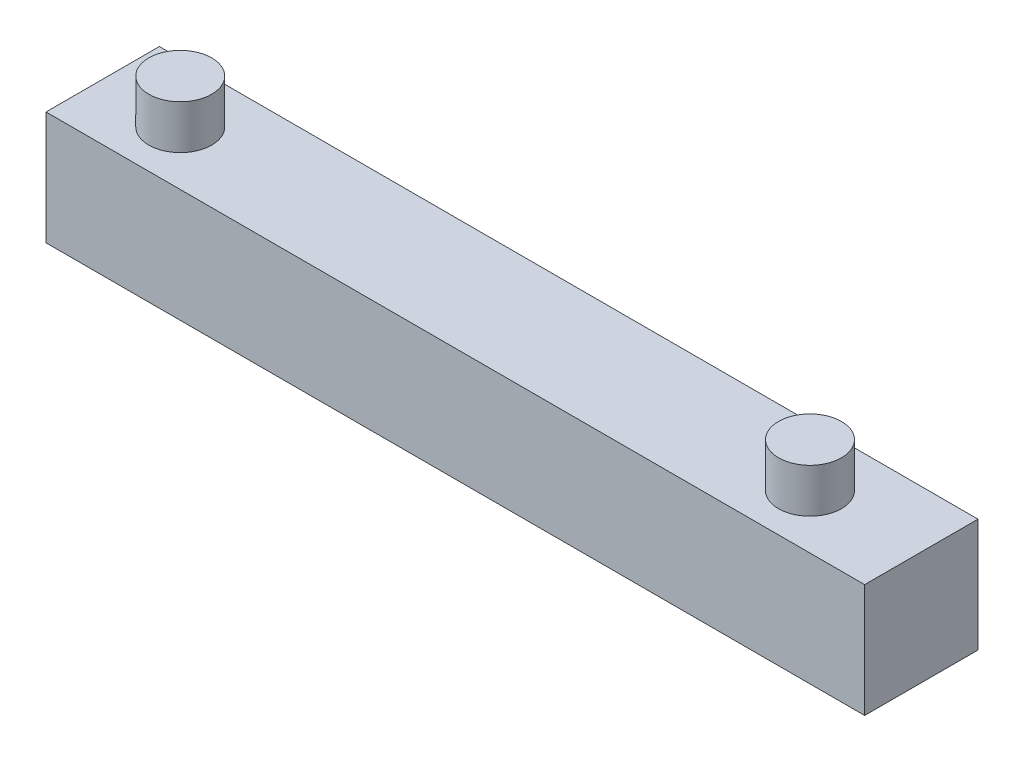
ISO-10303-21;
HEADER;
FILE_DESCRIPTION(('STEP AP214'),'2;1');
FILE_NAME('part.step','',(''),(''),'','','');
FILE_SCHEMA(('AUTOMOTIVE_DESIGN { 1 0 10303 214 1 1 1 1 }'));
ENDSEC;
DATA;
#1=APPLICATION_CONTEXT('core data for automotive mechanical design processes');
#2=APPLICATION_PROTOCOL_DEFINITION('international standard','automotive_design',2000,#1);
#3=PRODUCT_CONTEXT('',#1,'mechanical');
#4=PRODUCT('Part','Part','',(#3));
#5=PRODUCT_RELATED_PRODUCT_CATEGORY('part','',(#4));
#6=PRODUCT_DEFINITION_FORMATION('','',#4);
#7=PRODUCT_DEFINITION_CONTEXT('part definition',#1,'design');
#8=PRODUCT_DEFINITION('design','',#6,#7);
#9=PRODUCT_DEFINITION_SHAPE('','',#8);
#10=(LENGTH_UNIT() NAMED_UNIT(*) SI_UNIT(.MILLI.,.METRE.));
#11=(NAMED_UNIT(*) PLANE_ANGLE_UNIT() SI_UNIT($,.RADIAN.));
#12=(NAMED_UNIT(*) SI_UNIT($,.STERADIAN.) SOLID_ANGLE_UNIT());
#13=UNCERTAINTY_MEASURE_WITH_UNIT(LENGTH_MEASURE(1.E-05),#10,'distance_accuracy_value','');
#14=(GEOMETRIC_REPRESENTATION_CONTEXT(3) GLOBAL_UNCERTAINTY_ASSIGNED_CONTEXT((#13)) GLOBAL_UNIT_ASSIGNED_CONTEXT((#10,
#11,#12)) REPRESENTATION_CONTEXT('',''));
#15=CARTESIAN_POINT('',(0.,0.,0.));
#16=DIRECTION('',(0.,0.,1.));
#17=DIRECTION('',(1.,0.,0.));
#18=AXIS2_PLACEMENT_3D('',#15,#16,#17);
#19=CARTESIAN_POINT('',(0.,0.,90.));
#20=DIRECTION('',(1.,0.,0.));
#21=DIRECTION('',(0.,0.,-1.));
#22=AXIS2_PLACEMENT_3D('',#19,#20,#21);
#23=PLANE('',#22);
#24=DIRECTION('',(0.,-1.,0.));
#25=VECTOR('',#24,1.);
#26=CARTESIAN_POINT('',(0.,0.,0.));
#27=LINE('',#26,#25);
#28=CARTESIAN_POINT('',(0.,90.,0.));
#29=VERTEX_POINT('',#28);
#30=CARTESIAN_POINT('',(0.,0.,0.));
#31=VERTEX_POINT('',#30);
#32=EDGE_CURVE('E100',#29,#31,#27,.T.);
#33=ORIENTED_EDGE('',*,*,#32,.T.);
#34=DIRECTION('',(0.,0.,-1.));
#35=VECTOR('',#34,1.);
#36=CARTESIAN_POINT('',(0.,0.,90.));
#37=LINE('',#36,#35);
#38=CARTESIAN_POINT('',(0.,0.,90.));
#39=VERTEX_POINT('',#38);
#40=EDGE_CURVE('E91',#39,#31,#37,.T.);
#41=ORIENTED_EDGE('',*,*,#40,.F.);
#42=DIRECTION('',(0.,-1.,0.));
#43=VECTOR('',#42,1.);
#44=CARTESIAN_POINT('',(0.,0.,90.));
#45=LINE('',#44,#43);
#46=CARTESIAN_POINT('',(0.,90.,90.));
#47=VERTEX_POINT('',#46);
#48=EDGE_CURVE('E85',#47,#39,#45,.T.);
#49=ORIENTED_EDGE('',*,*,#48,.F.);
#50=DIRECTION('',(0.,0.,-1.));
#51=VECTOR('',#50,1.);
#52=CARTESIAN_POINT('',(0.,90.,90.));
#53=LINE('',#52,#51);
#54=EDGE_CURVE('E96',#47,#29,#53,.T.);
#55=ORIENTED_EDGE('',*,*,#54,.T.);
#56=EDGE_LOOP('',(#33,#41,#49,#55));
#57=FACE_BOUND('',#56,.T.);
#58=ADVANCED_FACE('F33',(#57),#23,.F.);
#59=CARTESIAN_POINT('',(0.,0.,90.));
#60=DIRECTION('',(0.,1.,0.));
#61=DIRECTION('',(0.,0.,1.));
#62=AXIS2_PLACEMENT_3D('',#59,#60,#61);
#63=PLANE('',#62);
#64=DIRECTION('',(1.,0.,0.));
#65=VECTOR('',#64,1.);
#66=CARTESIAN_POINT('',(0.,0.,0.));
#67=LINE('',#66,#65);
#68=CARTESIAN_POINT('',(650.,0.,0.));
#69=VERTEX_POINT('',#68);
#70=EDGE_CURVE('E90',#31,#69,#67,.T.);
#71=ORIENTED_EDGE('',*,*,#70,.T.);
#72=DIRECTION('',(0.,0.,-1.));
#73=VECTOR('',#72,1.);
#74=CARTESIAN_POINT('',(650.,0.,90.));
#75=LINE('',#74,#73);
#76=CARTESIAN_POINT('',(650.,0.,90.));
#77=VERTEX_POINT('',#76);
#78=EDGE_CURVE('E88',#77,#69,#75,.T.);
#79=ORIENTED_EDGE('',*,*,#78,.F.);
#80=DIRECTION('',(1.,0.,0.));
#81=VECTOR('',#80,1.);
#82=CARTESIAN_POINT('',(0.,0.,90.));
#83=LINE('',#82,#81);
#84=EDGE_CURVE('E80',#39,#77,#83,.T.);
#85=ORIENTED_EDGE('',*,*,#84,.F.);
#86=ORIENTED_EDGE('',*,*,#40,.T.);
#87=EDGE_LOOP('',(#71,#79,#85,#86));
#88=FACE_BOUND('',#87,.T.);
#89=ADVANCED_FACE('F89',(#88),#63,.F.);
#90=CARTESIAN_POINT('',(650.,0.,90.));
#91=DIRECTION('',(-1.,0.,0.));
#92=DIRECTION('',(0.,0.,1.));
#93=AXIS2_PLACEMENT_3D('',#90,#91,#92);
#94=PLANE('',#93);
#95=DIRECTION('',(0.,1.,0.));
#96=VECTOR('',#95,1.);
#97=CARTESIAN_POINT('',(650.,0.,0.));
#98=LINE('',#97,#96);
#99=CARTESIAN_POINT('',(650.,90.,0.));
#100=VERTEX_POINT('',#99);
#101=EDGE_CURVE('E66',#69,#100,#98,.T.);
#102=ORIENTED_EDGE('',*,*,#101,.T.);
#103=DIRECTION('',(0.,0.,-1.));
#104=VECTOR('',#103,1.);
#105=CARTESIAN_POINT('',(650.,90.,90.));
#106=LINE('',#105,#104);
#107=CARTESIAN_POINT('',(650.,90.,90.));
#108=VERTEX_POINT('',#107);
#109=EDGE_CURVE('E92',#108,#100,#106,.T.);
#110=ORIENTED_EDGE('',*,*,#109,.F.);
#111=DIRECTION('',(0.,1.,0.));
#112=VECTOR('',#111,1.);
#113=CARTESIAN_POINT('',(650.,0.,90.));
#114=LINE('',#113,#112);
#115=EDGE_CURVE('E83',#77,#108,#114,.T.);
#116=ORIENTED_EDGE('',*,*,#115,.F.);
#117=ORIENTED_EDGE('',*,*,#78,.T.);
#118=EDGE_LOOP('',(#102,#110,#116,#117));
#119=FACE_BOUND('',#118,.T.);
#120=ADVANCED_FACE('F94',(#119),#94,.F.);
#121=CARTESIAN_POINT('',(0.,90.,90.));
#122=DIRECTION('',(0.,-1.,0.));
#123=DIRECTION('',(0.,0.,-1.));
#124=AXIS2_PLACEMENT_3D('',#121,#122,#123);
#125=PLANE('',#124);
#126=CARTESIAN_POINT('',(563.608429309951,90.,47.0107043899231));
#127=DIRECTION('',(0.,-1.,0.));
#128=DIRECTION('',(0.,0.,-1.));
#129=AXIS2_PLACEMENT_3D('',#126,#127,#128);
#130=CIRCLE('',#129,25.);
#131=CARTESIAN_POINT('',(563.608429309951,90.,22.0107043899231));
#132=VERTEX_POINT('',#131);
#133=EDGE_CURVE('E11',#132,#132,#130,.F.);
#134=ORIENTED_EDGE('',*,*,#133,.F.);
#135=EDGE_LOOP('',(#134));
#136=FACE_BOUND('',#135,.T.);
#137=CARTESIAN_POINT('',(63.6084293099508,90.,47.0107043899231));
#138=DIRECTION('',(0.,-1.,0.));
#139=DIRECTION('',(0.,0.,-1.));
#140=AXIS2_PLACEMENT_3D('',#137,#138,#139);
#141=CIRCLE('',#140,25.);
#142=CARTESIAN_POINT('',(63.6084293099508,90.,22.0107043899231));
#143=VERTEX_POINT('',#142);
#144=EDGE_CURVE('E41',#143,#143,#141,.F.);
#145=ORIENTED_EDGE('',*,*,#144,.F.);
#146=EDGE_LOOP('',(#145));
#147=FACE_BOUND('',#146,.T.);
#148=DIRECTION('',(-1.,0.,0.));
#149=VECTOR('',#148,1.);
#150=CARTESIAN_POINT('',(0.,90.,0.));
#151=LINE('',#150,#149);
#152=EDGE_CURVE('E72',#100,#29,#151,.T.);
#153=ORIENTED_EDGE('',*,*,#152,.T.);
#154=ORIENTED_EDGE('',*,*,#54,.F.);
#155=DIRECTION('',(-1.,0.,0.));
#156=VECTOR('',#155,1.);
#157=CARTESIAN_POINT('',(0.,90.,90.));
#158=LINE('',#157,#156);
#159=EDGE_CURVE('E49',#108,#47,#158,.T.);
#160=ORIENTED_EDGE('',*,*,#159,.F.);
#161=ORIENTED_EDGE('',*,*,#109,.T.);
#162=EDGE_LOOP('',(#153,#154,#160,#161));
#163=FACE_BOUND('',#162,.T.);
#164=ADVANCED_FACE('F114',(#136,#147,#163),#125,.F.);
#165=CARTESIAN_POINT('',(0.,0.,90.));
#166=DIRECTION('',(0.,0.,-1.));
#167=DIRECTION('',(-1.,0.,0.));
#168=AXIS2_PLACEMENT_3D('',#165,#166,#167);
#169=PLANE('',#168);
#170=ORIENTED_EDGE('',*,*,#48,.T.);
#171=ORIENTED_EDGE('',*,*,#84,.T.);
#172=ORIENTED_EDGE('',*,*,#115,.T.);
#173=ORIENTED_EDGE('',*,*,#159,.T.);
#174=EDGE_LOOP('',(#170,#171,#172,#173));
#175=FACE_BOUND('',#174,.T.);
#176=ADVANCED_FACE('F81',(#175),#169,.F.);
#177=CARTESIAN_POINT('',(0.,0.,0.));
#178=DIRECTION('',(0.,0.,-1.));
#179=DIRECTION('',(-1.,0.,0.));
#180=AXIS2_PLACEMENT_3D('',#177,#178,#179);
#181=PLANE('',#180);
#182=ORIENTED_EDGE('',*,*,#32,.F.);
#183=ORIENTED_EDGE('',*,*,#152,.F.);
#184=ORIENTED_EDGE('',*,*,#101,.F.);
#185=ORIENTED_EDGE('',*,*,#70,.F.);
#186=EDGE_LOOP('',(#182,#183,#184,#185));
#187=FACE_BOUND('',#186,.T.);
#188=ADVANCED_FACE('F122',(#187),#181,.T.);
#189=CARTESIAN_POINT('',(63.6084293099508,125.,47.0107043899231));
#190=DIRECTION('',(0.,-1.,0.));
#191=DIRECTION('',(0.,0.,-1.));
#192=AXIS2_PLACEMENT_3D('',#189,#190,#191);
#193=CYLINDRICAL_SURFACE('',#192,25.);
#194=CARTESIAN_POINT('',(63.6084293099508,125.,47.0107043899231));
#195=DIRECTION('',(0.,1.,0.));
#196=DIRECTION('',(0.,0.,1.));
#197=AXIS2_PLACEMENT_3D('',#194,#195,#196);
#198=CIRCLE('',#197,25.);
#199=CARTESIAN_POINT('',(63.6084293099508,125.,72.0107043899231));
#200=VERTEX_POINT('',#199);
#201=EDGE_CURVE('E103',#200,#200,#198,.T.);
#202=ORIENTED_EDGE('',*,*,#201,.F.);
#203=EDGE_LOOP('',(#202));
#204=FACE_BOUND('',#203,.T.);
#205=ORIENTED_EDGE('',*,*,#144,.T.);
#206=EDGE_LOOP('',(#205));
#207=FACE_BOUND('',#206,.T.);
#208=ADVANCED_FACE('F112',(#204,#207),#193,.T.);
#209=CARTESIAN_POINT('',(63.6084293099508,125.,47.0107043899231));
#210=DIRECTION('',(0.,1.,0.));
#211=DIRECTION('',(0.,0.,1.));
#212=AXIS2_PLACEMENT_3D('',#209,#210,#211);
#213=PLANE('',#212);
#214=ORIENTED_EDGE('',*,*,#201,.T.);
#215=EDGE_LOOP('',(#214));
#216=FACE_BOUND('',#215,.T.);
#217=ADVANCED_FACE('F138',(#216),#213,.T.);
#218=CARTESIAN_POINT('',(563.608429309951,125.,47.0107043899231));
#219=DIRECTION('',(0.,-1.,0.));
#220=DIRECTION('',(0.,0.,-1.));
#221=AXIS2_PLACEMENT_3D('',#218,#219,#220);
#222=CYLINDRICAL_SURFACE('',#221,25.);
#223=CARTESIAN_POINT('',(563.608429309951,125.,47.0107043899231));
#224=DIRECTION('',(0.,1.,0.));
#225=DIRECTION('',(0.,0.,1.));
#226=AXIS2_PLACEMENT_3D('',#223,#224,#225);
#227=CIRCLE('',#226,25.);
#228=CARTESIAN_POINT('',(563.608429309951,125.,72.0107043899231));
#229=VERTEX_POINT('',#228);
#230=EDGE_CURVE('E156',#229,#229,#227,.T.);
#231=ORIENTED_EDGE('',*,*,#230,.F.);
#232=EDGE_LOOP('',(#231));
#233=FACE_BOUND('',#232,.T.);
#234=ORIENTED_EDGE('',*,*,#133,.T.);
#235=EDGE_LOOP('',(#234));
#236=FACE_BOUND('',#235,.T.);
#237=ADVANCED_FACE('F144',(#233,#236),#222,.T.);
#238=CARTESIAN_POINT('',(563.608429309951,125.,47.0107043899231));
#239=DIRECTION('',(0.,1.,0.));
#240=DIRECTION('',(0.,0.,1.));
#241=AXIS2_PLACEMENT_3D('',#238,#239,#240);
#242=PLANE('',#241);
#243=ORIENTED_EDGE('',*,*,#230,.T.);
#244=EDGE_LOOP('',(#243));
#245=FACE_BOUND('',#244,.T.);
#246=ADVANCED_FACE('F148',(#245),#242,.T.);
#247=CLOSED_SHELL('',(#58,#89,#120,#164,#176,#188,#208,#217,#237,#246));
#248=MANIFOLD_SOLID_BREP('B2',#247);
#249=ADVANCED_BREP_SHAPE_REPRESENTATION('',(#18,#248),#14);
#250=SHAPE_DEFINITION_REPRESENTATION(#9,#249);
ENDSEC;
END-ISO-10303-21;
